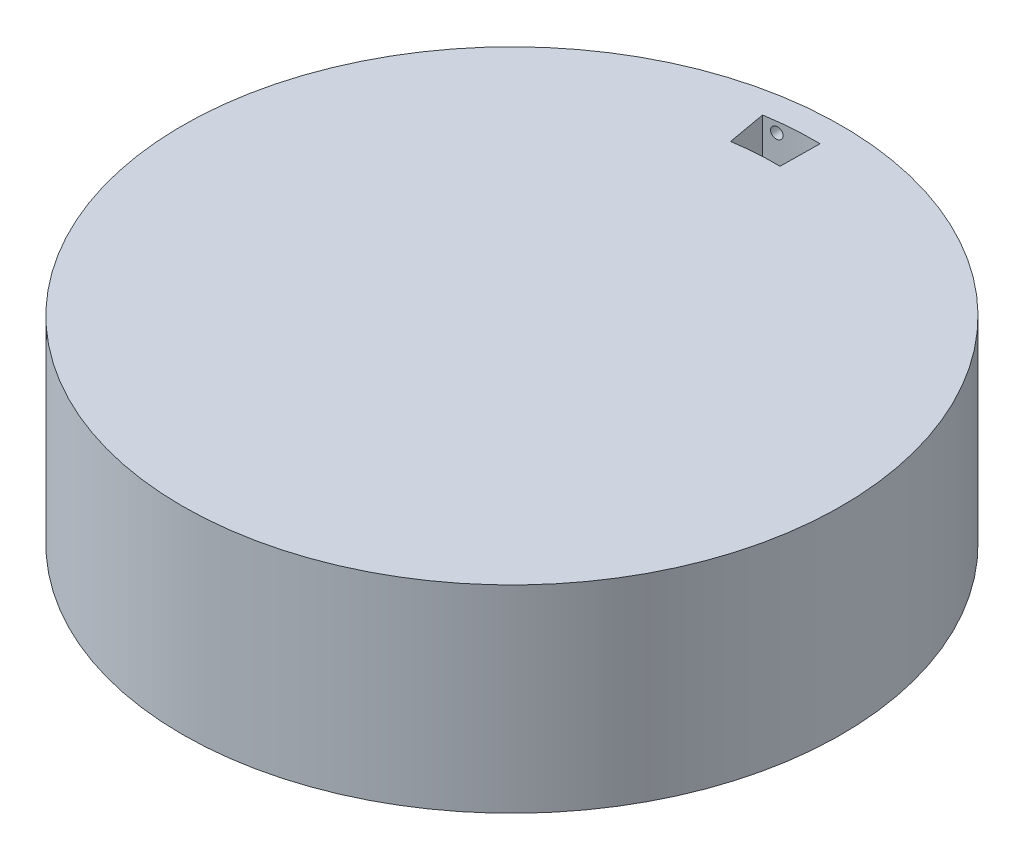
ISO-10303-21;
HEADER;
FILE_DESCRIPTION(('STEP AP214'),'2;1');
FILE_NAME('part.step','',(''),(''),'','','');
FILE_SCHEMA(('AUTOMOTIVE_DESIGN { 1 0 10303 214 1 1 1 1 }'));
ENDSEC;
DATA;
#1=APPLICATION_CONTEXT('core data for automotive mechanical design processes');
#2=APPLICATION_PROTOCOL_DEFINITION('international standard','automotive_design',2000,#1);
#3=PRODUCT_CONTEXT('',#1,'mechanical');
#4=PRODUCT('Part','Part','',(#3));
#5=PRODUCT_RELATED_PRODUCT_CATEGORY('part','',(#4));
#6=PRODUCT_DEFINITION_FORMATION('','',#4);
#7=PRODUCT_DEFINITION_CONTEXT('part definition',#1,'design');
#8=PRODUCT_DEFINITION('design','',#6,#7);
#9=PRODUCT_DEFINITION_SHAPE('','',#8);
#10=(LENGTH_UNIT() NAMED_UNIT(*) SI_UNIT(.MILLI.,.METRE.));
#11=(NAMED_UNIT(*) PLANE_ANGLE_UNIT() SI_UNIT($,.RADIAN.));
#12=(NAMED_UNIT(*) SI_UNIT($,.STERADIAN.) SOLID_ANGLE_UNIT());
#13=UNCERTAINTY_MEASURE_WITH_UNIT(LENGTH_MEASURE(1.E-05),#10,'distance_accuracy_value','');
#14=(GEOMETRIC_REPRESENTATION_CONTEXT(3) GLOBAL_UNCERTAINTY_ASSIGNED_CONTEXT((#13)) GLOBAL_UNIT_ASSIGNED_CONTEXT((#10,
#11,#12)) REPRESENTATION_CONTEXT('',''));
#15=CARTESIAN_POINT('',(0.,0.,0.));
#16=DIRECTION('',(0.,0.,1.));
#17=DIRECTION('',(1.,0.,0.));
#18=AXIS2_PLACEMENT_3D('',#15,#16,#17);
#19=CARTESIAN_POINT('',(0.,19.05,0.));
#20=DIRECTION('',(0.,-1.,0.));
#21=DIRECTION('',(0.,0.,-1.));
#22=AXIS2_PLACEMENT_3D('',#19,#20,#21);
#23=CYLINDRICAL_SURFACE('',#22,31.75);
#24=CARTESIAN_POINT('',(0.,19.05,0.));
#25=DIRECTION('',(0.,1.,0.));
#26=DIRECTION('',(0.,0.,1.));
#27=AXIS2_PLACEMENT_3D('',#24,#25,#26);
#28=CIRCLE('',#27,31.75);
#29=CARTESIAN_POINT('',(0.,19.05,31.75));
#30=VERTEX_POINT('',#29);
#31=EDGE_CURVE('E11',#30,#30,#28,.T.);
#32=ORIENTED_EDGE('',*,*,#31,.F.);
#33=EDGE_LOOP('',(#32));
#34=FACE_BOUND('',#33,.T.);
#35=CARTESIAN_POINT('',(0.,0.,0.));
#36=DIRECTION('',(0.,1.,0.));
#37=DIRECTION('',(0.,0.,1.));
#38=AXIS2_PLACEMENT_3D('',#35,#36,#37);
#39=CIRCLE('',#38,31.75);
#40=CARTESIAN_POINT('',(0.,0.,31.75));
#41=VERTEX_POINT('',#40);
#42=EDGE_CURVE('E46',#41,#41,#39,.T.);
#43=ORIENTED_EDGE('',*,*,#42,.T.);
#44=EDGE_LOOP('',(#43));
#45=FACE_BOUND('',#44,.T.);
#46=CARTESIAN_POINT('',(-3.12525942523335,18.0771235572389,-31.5958106958025));
#47=CARTESIAN_POINT('',(-3.12526076554641,18.0468170057154,-31.5958106025486));
#48=CARTESIAN_POINT('',(-3.1278092079593,18.0164885358174,-31.5955588092377));
#49=CARTESIAN_POINT('',(-3.13793964137095,17.9566670023404,-31.5945542731379));
#50=CARTESIAN_POINT('',(-3.14552767496288,17.9271749860068,-31.5938009289746));
#51=CARTESIAN_POINT('',(-3.1655199468469,17.8699016702083,-31.5918040607363));
#52=CARTESIAN_POINT('',(-3.17792187158234,17.8421195563837,-31.5905607721242));
#53=CARTESIAN_POINT('',(-3.2071846849655,17.7890497276316,-31.5876032900118));
#54=CARTESIAN_POINT('',(-3.22404446720966,17.7637613959032,-31.585889213353));
#55=CARTESIAN_POINT('',(-3.26174699021799,17.7163825279151,-31.5820180590139));
#56=CARTESIAN_POINT('',(-3.2825905216796,17.6942926280149,-31.5798608933826));
#57=CARTESIAN_POINT('',(-3.32766468560591,17.6539419676309,-31.5751430738043));
#58=CARTESIAN_POINT('',(-3.35189545381195,17.6356813606768,-31.5725824036866));
#59=CARTESIAN_POINT('',(-3.40306153070392,17.6035013523667,-31.5671084107032));
#60=CARTESIAN_POINT('',(-3.42999773846586,17.5895834005208,-31.5641949705377));
#61=CARTESIAN_POINT('',(-3.48580107528537,17.5664896632211,-31.5580810242955));
#62=CARTESIAN_POINT('',(-3.51466820690175,17.5573138840516,-31.5548805178383));
#63=CARTESIAN_POINT('',(-3.57353357868338,17.5439574791415,-31.5482683374017));
#64=CARTESIAN_POINT('',(-3.60353258134882,17.5397802850571,-31.5448565200401));
#65=CARTESIAN_POINT('',(-3.66379161835591,17.5365485073161,-31.5379144953203));
#66=CARTESIAN_POINT('',(-3.6940516536695,17.5374939427414,-31.5343842875211));
#67=CARTESIAN_POINT('',(-3.75400228000211,17.5444819290752,-31.5273037060796));
#68=CARTESIAN_POINT('',(-3.7836923476891,17.5505289547919,-31.5237533174522));
#69=CARTESIAN_POINT('',(-3.84163495649671,17.5675538197707,-31.5167446461914));
#70=CARTESIAN_POINT('',(-3.86988748940726,17.5785316871903,-31.5132863640841));
#71=CARTESIAN_POINT('',(-3.92416985953124,17.6051147283195,-31.5065729664682));
#72=CARTESIAN_POINT('',(-3.95019850782746,17.6207223574671,-31.5033179598804));
#73=CARTESIAN_POINT('',(-3.99927829404469,17.6561215171713,-31.4971250431411));
#74=CARTESIAN_POINT('',(-4.02232943577863,17.67591304237,-31.4941871325835));
#75=CARTESIAN_POINT('',(-4.06478979286835,17.7191104888246,-31.4887351764102));
#76=CARTESIAN_POINT('',(-4.0842006297379,17.7425147923179,-31.4862209421258));
#77=CARTESIAN_POINT('',(-4.11884010237718,17.7922812704057,-31.4817083770776));
#78=CARTESIAN_POINT('',(-4.13406877071007,17.8186434219677,-31.4797100422969));
#79=CARTESIAN_POINT('',(-4.15988960830395,17.8735364265157,-31.4763083705999));
#80=CARTESIAN_POINT('',(-4.17048851912529,17.9020640546894,-31.4749041686391));
#81=CARTESIAN_POINT('',(-4.18677883401994,17.9605109909301,-31.4727413980491));
#82=CARTESIAN_POINT('',(-4.19247028804643,17.9904302848279,-31.4719828228482));
#83=CARTESIAN_POINT('',(-4.19877745324486,18.0507602772372,-31.4711419910947));
#84=CARTESIAN_POINT('',(-4.19940121832598,18.0811701190237,-31.4710586613976));
#85=CARTESIAN_POINT('',(-4.19557634551408,18.141663258698,-31.4715687996807));
#86=CARTESIAN_POINT('',(-4.1911277310295,18.1717465580921,-31.4721622645377));
#87=CARTESIAN_POINT('',(-4.17728916214586,18.2307164940178,-31.4740020245004));
#88=CARTESIAN_POINT('',(-4.16790182188518,18.2596037549122,-31.475247974235));
#89=CARTESIAN_POINT('',(-4.14445516685813,18.3153806885418,-31.4783438318953));
#90=CARTESIAN_POINT('',(-4.13039583293448,18.3422703530853,-31.4801937422975));
#91=CARTESIAN_POINT('',(-4.09798933096607,18.3933172098142,-31.4844286864348));
#92=CARTESIAN_POINT('',(-4.07963810278701,18.4174717822876,-31.4868142267902));
#93=CARTESIAN_POINT('',(-4.03917549971209,18.4623380619208,-31.4920303615999));
#94=CARTESIAN_POINT('',(-4.01706408807127,18.4830497354322,-31.4948609604033));
#95=CARTESIAN_POINT('',(-3.96966604581224,18.5204790557008,-31.5008701788292));
#96=CARTESIAN_POINT('',(-3.94437413937999,18.5371899289865,-31.5040493755582));
#97=CARTESIAN_POINT('',(-3.8913597414398,18.56610147699,-31.5106415667075));
#98=CARTESIAN_POINT('',(-3.86363723432777,18.5783021227503,-31.5140545626286));
#99=CARTESIAN_POINT('',(-3.8065102372321,18.5978606131809,-31.5210058225574));
#100=CARTESIAN_POINT('',(-3.77710375606347,18.6052125905344,-31.5245442328943));
#101=CARTESIAN_POINT('',(-3.71747241845715,18.6148410925588,-31.5316317371433));
#102=CARTESIAN_POINT('',(-3.68724755934694,18.617117600653,-31.5351808310902));
#103=CARTESIAN_POINT('',(-3.62683371315476,18.61652886411,-31.5421860697186));
#104=CARTESIAN_POINT('',(-3.59664473032063,18.6136630615754,-31.5456422042734));
#105=CARTESIAN_POINT('',(-3.5371645048993,18.6028676815984,-31.5523670020045));
#106=CARTESIAN_POINT('',(-3.50787326106989,18.5949381111631,-31.5556356654403));
#107=CARTESIAN_POINT('',(-3.4510431567855,18.5742454606783,-31.5619013768801));
#108=CARTESIAN_POINT('',(-3.42350310314376,18.5614857138319,-31.5648986104287));
#109=CARTESIAN_POINT('',(-3.37094017127748,18.5314933424298,-31.5705553009126));
#110=CARTESIAN_POINT('',(-3.34591718323992,18.5142609131232,-31.5732147725849));
#111=CARTESIAN_POINT('',(-3.29912482009234,18.4758304169682,-31.5781384731876));
#112=CARTESIAN_POINT('',(-3.27735233893367,18.4546361800507,-31.5804030797866));
#113=CARTESIAN_POINT('',(-3.23764895735968,18.4088655521131,-31.5844982350258));
#114=CARTESIAN_POINT('',(-3.21971899867532,18.3842883344055,-31.586328677272));
#115=CARTESIAN_POINT('',(-3.18822228296077,18.3324607173417,-31.5895234224894));
#116=CARTESIAN_POINT('',(-3.17465506388848,18.3052106014618,-31.5908877748233));
#117=CARTESIAN_POINT('',(-3.15228119044929,18.2488288117805,-31.5931282231978));
#118=CARTESIAN_POINT('',(-3.14346883335557,18.2196994390364,-31.5940049041644));
#119=CARTESIAN_POINT('',(-3.13320121152909,18.1715079427637,-31.5950243669013));
#120=CARTESIAN_POINT('',(-3.13022678422421,18.1527589722385,-31.5953190255915));
#121=CARTESIAN_POINT('',(-3.12625547176204,18.1150507154179,-31.595712219213));
#122=CARTESIAN_POINT('',(-3.12525858637557,18.0960914291468,-31.5958107541671));
#123=CARTESIAN_POINT('',(-3.12525942523335,18.0771235572389,-31.5958106958025));
#124=B_SPLINE_CURVE_WITH_KNOTS('',3,(#46,#47,#48,#49,#50,#51,#52,#53,#54,#55,#56,#57,#58,#59,
#60,#61,#62,#63,#64,#65,#66,#67,#68,#69,#70,#71,#72,#73,#74,#75,#76,#77,#78,#79,#80,#81,#82,#83,
#84,#85,#86,#87,#88,#89,#90,#91,#92,#93,#94,#95,#96,#97,#98,#99,#100,#101,#102,#103,#104,#105,
#106,#107,#108,#109,#110,#111,#112,#113,#114,#115,#116,#117,#118,#119,#120,#121,#122,#123),
.UNSPECIFIED.,.T.,.F.,(4,2,2,2,2,2,2,2,2,2,2,2,2,2,2,2,2,2,2,2,2,2,2,2,2,2,2,2,2,2,2,2,2,2,2,2,
2,2,4),(0.,0.0908504213364582,0.181809971687633,0.272725860886908,0.363619206656865,
0.454530611774306,0.545445661152898,0.636391024165632,0.727336507698437,0.818344391869951,
0.909352615047019,1.00044074826306,1.09152940164504,1.18266645139431,1.27380338443482,
1.36489962510752,1.45599515646773,1.54695759445728,1.63791910652595,1.72873602815941,
1.81955253068498,1.91032101102541,2.00108986356217,2.0919449333109,2.18280089095693,
2.27380959951642,2.36481889238137,2.45593811343469,2.54705763208613,2.63818703703571,
2.72931631588268,2.82038282263629,2.91144535467068,3.00242030641294,3.09341752899406,
3.18440511120929,3.27528332384855,3.33214361536175,3.38900390028578),.UNSPECIFIED.);
#125=CARTESIAN_POINT('',(-3.12525942523335,18.0771235572389,-31.5958106958025));
#126=VERTEX_POINT('',#125);
#127=EDGE_CURVE('E112',#126,#126,#124,.T.);
#128=ORIENTED_EDGE('',*,*,#127,.F.);
#129=EDGE_LOOP('',(#128));
#130=FACE_BOUND('',#129,.T.);
#131=ADVANCED_FACE('F33',(#34,#45,#130),#23,.T.);
#132=CARTESIAN_POINT('',(0.,13.97,0.));
#133=DIRECTION('',(0.,1.,0.));
#134=DIRECTION('',(0.,0.,1.));
#135=AXIS2_PLACEMENT_3D('',#132,#133,#134);
#136=CYLINDRICAL_SURFACE('',#135,29.21);
#137=CARTESIAN_POINT('',(0.,19.05,0.));
#138=DIRECTION('',(0.,1.,0.));
#139=DIRECTION('',(0.,0.,1.));
#140=AXIS2_PLACEMENT_3D('',#137,#138,#139);
#141=CIRCLE('',#140,29.21);
#142=CARTESIAN_POINT('',(0.481566937098626,19.05,-29.206030084301));
#143=VERTEX_POINT('',#142);
#144=CARTESIAN_POINT('',(-4.6853282453756,19.05,-28.8317845308452));
#145=VERTEX_POINT('',#144);
#146=EDGE_CURVE('E54',#143,#145,#141,.T.);
#147=ORIENTED_EDGE('',*,*,#146,.T.);
#148=DIRECTION('',(0.,1.,0.));
#149=VECTOR('',#148,1.);
#150=CARTESIAN_POINT('',(-4.6853282453756,13.97,-28.8317845308452));
#151=LINE('',#150,#149);
#152=CARTESIAN_POINT('',(-4.6853282453756,13.97,-28.8317845308452));
#153=VERTEX_POINT('',#152);
#154=EDGE_CURVE('E77',#153,#145,#151,.T.);
#155=ORIENTED_EDGE('',*,*,#154,.F.);
#156=CARTESIAN_POINT('',(0.,13.97,0.));
#157=DIRECTION('',(0.,1.,0.));
#158=DIRECTION('',(0.,0.,1.));
#159=AXIS2_PLACEMENT_3D('',#156,#157,#158);
#160=CIRCLE('',#159,29.21);
#161=CARTESIAN_POINT('',(0.481566937098626,13.97,-29.206030084301));
#162=VERTEX_POINT('',#161);
#163=EDGE_CURVE('E104',#162,#153,#160,.T.);
#164=ORIENTED_EDGE('',*,*,#163,.F.);
#165=DIRECTION('',(0.,1.,0.));
#166=VECTOR('',#165,1.);
#167=CARTESIAN_POINT('',(0.481566937098626,13.97,-29.206030084301));
#168=LINE('',#167,#166);
#169=EDGE_CURVE('E62',#162,#143,#168,.T.);
#170=ORIENTED_EDGE('',*,*,#169,.T.);
#171=EDGE_LOOP('',(#147,#155,#164,#170));
#172=FACE_BOUND('',#171,.T.);
#173=CARTESIAN_POINT('',(-2.94501252342107,18.0771235572389,-29.0611596677919));
#174=CARTESIAN_POINT('',(-2.94501386359778,18.1074282862848,-29.0611595747194));
#175=CARTESIAN_POINT('',(-2.94756156666853,18.1377549221551,-29.0609017017233));
#176=CARTESIAN_POINT('',(-2.95768900451406,18.1975728119434,-29.059872688316));
#177=CARTESIAN_POINT('',(-2.96527477716478,18.2270630191715,-29.0591009320385));
#178=CARTESIAN_POINT('',(-2.9852609056362,18.2843327961669,-29.0570545248415));
#179=CARTESIAN_POINT('',(-2.99765894629118,18.3121131810893,-29.055780115742));
#180=CARTESIAN_POINT('',(-3.02691222261363,18.3651797467876,-29.0527471606522));
#181=CARTESIAN_POINT('',(-3.04376635274206,18.3904665440798,-29.0509887347402));
#182=CARTESIAN_POINT('',(-3.08145594911297,18.4378431055732,-29.0470151186832));
#183=CARTESIAN_POINT('',(-3.10229227351677,18.4599321788597,-29.0447998300763));
#184=CARTESIAN_POINT('',(-3.14735003474065,18.5002816737146,-29.0399517921841));
#185=CARTESIAN_POINT('',(-3.1715716077285,18.5185419411997,-29.0373190261057));
#186=CARTESIAN_POINT('',(-3.22271886854145,18.5507231527316,-29.0316869005019));
#187=CARTESIAN_POINT('',(-3.24964562685011,18.5646423699442,-29.0286873957496));
#188=CARTESIAN_POINT('',(-3.30542834278996,18.587739343562,-29.0223884362513));
#189=CARTESIAN_POINT('',(-3.33428430414118,18.596917090824,-29.019088980927));
#190=CARTESIAN_POINT('',(-3.39312954869435,18.6102794305357,-29.0122672228742));
#191=CARTESIAN_POINT('',(-3.42311973123523,18.6144599712151,-29.008744741748));
#192=CARTESIAN_POINT('',(-3.48336030260942,18.617698742081,-29.0015727331815));
#193=CARTESIAN_POINT('',(-3.51361069267136,18.6167569480681,-28.9979232051412));
#194=CARTESIAN_POINT('',(-3.57354662437574,18.6097761987452,-28.9905980828249));
#195=CARTESIAN_POINT('',(-3.60323154742017,18.6037319560947,-28.9869224654335));
#196=CARTESIAN_POINT('',(-3.6611639664627,18.5867115599872,-28.9796623728851));
#197=CARTESIAN_POINT('',(-3.68941145302955,18.5757353741755,-28.9760778983263));
#198=CARTESIAN_POINT('',(-3.74368695401046,18.5491530696839,-28.969115587179));
#199=CARTESIAN_POINT('',(-3.76971356243814,18.533544045652,-28.9657378818682));
#200=CARTESIAN_POINT('',(-3.81878951352731,18.4981395704351,-28.9593086961582));
#201=CARTESIAN_POINT('',(-3.84183886045167,18.4783441252443,-28.9562572152919));
#202=CARTESIAN_POINT('',(-3.88429396416955,18.4351378063948,-28.950592738537));
#203=CARTESIAN_POINT('',(-3.90370163461588,18.4117288434464,-28.9479795124283));
#204=CARTESIAN_POINT('',(-3.93833498705057,18.3619507266019,-28.9432880641707));
#205=CARTESIAN_POINT('',(-3.95356070765966,18.3355816000466,-28.941209837081));
#206=CARTESIAN_POINT('',(-3.97937182408964,18.2806799560579,-28.937672161833));
#207=CARTESIAN_POINT('',(-3.98996518633458,18.2521512524618,-28.9362116515092));
#208=CARTESIAN_POINT('',(-4.00624606078686,18.1937015390188,-28.9339620625273));
#209=CARTESIAN_POINT('',(-4.01193363202349,18.1637805459294,-28.9331729757901));
#210=CARTESIAN_POINT('',(-4.01823353636565,18.1034558550299,-28.932298725795));
#211=CARTESIAN_POINT('',(-4.01885538498896,18.0730531697711,-28.932212242758));
#212=CARTESIAN_POINT('',(-4.01503104899324,18.01257459304,-28.9327432032401));
#213=CARTESIAN_POINT('',(-4.01058489202697,17.9824986997857,-28.9333606429182));
#214=CARTESIAN_POINT('',(-3.99675644548081,17.9235465426482,-28.9352740800931));
#215=CARTESIAN_POINT('',(-3.98737724187348,17.8946695409444,-28.9365696533665));
#216=CARTESIAN_POINT('',(-3.96395244193601,17.8389123363818,-28.939787836204));
#217=CARTESIAN_POINT('',(-3.94990682289545,17.8120321432418,-28.9417104488197));
#218=CARTESIAN_POINT('',(-3.91753035908319,17.7609980131804,-28.9461106553269));
#219=CARTESIAN_POINT('',(-3.89919472123731,17.7368471707478,-28.9485888698407));
#220=CARTESIAN_POINT('',(-3.8587668293795,17.6919865177031,-28.9540054811888));
#221=CARTESIAN_POINT('',(-3.83667453230696,17.6712767465396,-28.9569438832978));
#222=CARTESIAN_POINT('',(-3.78931012920254,17.6338426618608,-28.9631800628777));
#223=CARTESIAN_POINT('',(-3.76403179286047,17.6171263482339,-28.9664785427421));
#224=CARTESIAN_POINT('',(-3.7110445063369,17.5882030866645,-28.9733146422656));
#225=CARTESIAN_POINT('',(-3.68333553725029,17.5759961737993,-28.9768522637847));
#226=CARTESIAN_POINT('',(-3.6262283525028,17.5564219862342,-28.9840541796216));
#227=CARTESIAN_POINT('',(-3.59682778135366,17.5490616466663,-28.987718647596));
#228=CARTESIAN_POINT('',(-3.53720614116574,17.5394178644876,-28.9950543112095));
#229=CARTESIAN_POINT('',(-3.5069850692261,17.5371344398284,-28.9987255068723));
#230=CARTESIAN_POINT('',(-3.44657587109917,17.5377112834287,-29.0059673226669));
#231=CARTESIAN_POINT('',(-3.41638774966688,17.5405722155273,-29.0095379297581));
#232=CARTESIAN_POINT('',(-3.35690719176623,17.5513605546064,-29.0164810241249));
#233=CARTESIAN_POINT('',(-3.32761475350472,17.5592879514431,-29.0198535117971));
#234=CARTESIAN_POINT('',(-3.27078445373798,17.5799780482676,-29.0263136993222));
#235=CARTESIAN_POINT('',(-3.24324517787049,17.5927367913128,-29.0294016296653));
#236=CARTESIAN_POINT('',(-3.19068247815141,17.6227293585394,-29.035225940978));
#237=CARTESIAN_POINT('',(-3.16565894253483,17.6399629837965,-29.0379623375664));
#238=CARTESIAN_POINT('',(-3.11886856368138,17.6783951285642,-29.0430252058788));
#239=CARTESIAN_POINT('',(-3.09709811203138,17.6995891953976,-29.0453521323155));
#240=CARTESIAN_POINT('',(-3.0573977112431,17.7453605733204,-29.0495579817555));
#241=CARTESIAN_POINT('',(-3.03946870094787,17.7699387090663,-29.0514367952531));
#242=CARTESIAN_POINT('',(-3.00797495693632,17.8217663912502,-29.0547145590086));
#243=CARTESIAN_POINT('',(-2.99440929871009,17.8490153701898,-29.0561136109227));
#244=CARTESIAN_POINT('',(-2.97203729382089,17.90539531885,-29.0584105208562));
#245=CARTESIAN_POINT('',(-2.96322524669808,17.9345239873091,-29.0593089792226));
#246=CARTESIAN_POINT('',(-2.95295640250142,17.9827187814068,-29.0603538016617));
#247=CARTESIAN_POINT('',(-2.94998119502738,18.0014717296258,-29.0606557909923));
#248=CARTESIAN_POINT('',(-2.94600883611971,18.0391881090301,-29.0610587531773));
#249=CARTESIAN_POINT('',(-2.94501168441487,18.0581515401865,-29.0611597260591));
#250=CARTESIAN_POINT('',(-2.94501252342107,18.0771235572389,-29.0611596677919));
#251=B_SPLINE_CURVE_WITH_KNOTS('',3,(#173,#174,#175,#176,#177,#178,#179,#180,#181,#182,#183,
#184,#185,#186,#187,#188,#189,#190,#191,#192,#193,#194,#195,#196,#197,#198,#199,#200,#201,#202,
#203,#204,#205,#206,#207,#208,#209,#210,#211,#212,#213,#214,#215,#216,#217,#218,#219,#220,#221,
#222,#223,#224,#225,#226,#227,#228,#229,#230,#231,#232,#233,#234,#235,#236,#237,#238,#239,#240,
#241,#242,#243,#244,#245,#246,#247,#248,#249,#250),.UNSPECIFIED.,.T.,.F.,(4,2,2,2,2,2,2,2,2,2,2,
2,2,2,2,2,2,2,2,2,2,2,2,2,2,2,2,2,2,2,2,2,2,2,2,2,2,2,4),(0.,0.0908449386639816,
0.181798947407008,0.272709252614819,0.363597024447625,0.454504404690006,0.545415442630856,
0.63636259824217,0.727309929229972,0.81833095104538,0.909352402871952,1.00046829033597,
1.09158477554956,1.18275852303061,1.27393213996691,1.36505771137231,1.45618244119561,
1.54714983844929,1.63811614111572,1.72891153202878,1.81970642753335,1.9104445917921,
2.00118319766039,2.09202367053803,2.18286518474251,2.27388717911662,2.36490988150958,
2.45606255006651,2.54721554093234,2.63838029522555,2.72954486699694,2.82063493458943,
2.91172095359919,3.00270517519084,3.09371160790241,3.18469874538974,3.27557652852192,
3.33244923506078,3.38932193380187),.UNSPECIFIED.);
#252=CARTESIAN_POINT('',(-2.94501252342107,18.0771235572389,-29.0611596677919));
#253=VERTEX_POINT('',#252);
#254=EDGE_CURVE('E151',#253,#253,#251,.T.);
#255=ORIENTED_EDGE('',*,*,#254,.F.);
#256=EDGE_LOOP('',(#255));
#257=FACE_BOUND('',#256,.T.);
#258=ADVANCED_FACE('F136',(#172,#257),#136,.F.);
#259=CARTESIAN_POINT('',(0.,13.97,0.));
#260=DIRECTION('',(0.,1.,0.));
#261=DIRECTION('',(0.,0.,1.));
#262=AXIS2_PLACEMENT_3D('',#259,#260,#261);
#263=CYLINDRICAL_SURFACE('',#262,25.4);
#264=CARTESIAN_POINT('',(0.,19.05,0.));
#265=DIRECTION('',(0.,-1.,0.));
#266=DIRECTION('',(0.,0.,1.));
#267=AXIS2_PLACEMENT_3D('',#264,#265,#266);
#268=CIRCLE('',#267,25.4);
#269=CARTESIAN_POINT('',(-4.02136453273724,19.05,-25.0796456772189));
#270=VERTEX_POINT('',#269);
#271=CARTESIAN_POINT('',(0.431861346172182,19.05,-25.3963283916727));
#272=VERTEX_POINT('',#271);
#273=EDGE_CURVE('E114',#270,#272,#268,.T.);
#274=ORIENTED_EDGE('',*,*,#273,.T.);
#275=DIRECTION('',(0.,1.,0.));
#276=VECTOR('',#275,1.);
#277=CARTESIAN_POINT('',(0.431861346172182,13.97,-25.3963283916727));
#278=LINE('',#277,#276);
#279=CARTESIAN_POINT('',(0.431861346172182,13.97,-25.3963283916727));
#280=VERTEX_POINT('',#279);
#281=EDGE_CURVE('E93',#280,#272,#278,.T.);
#282=ORIENTED_EDGE('',*,*,#281,.F.);
#283=CARTESIAN_POINT('',(0.,13.97,0.));
#284=DIRECTION('',(0.,-1.,0.));
#285=DIRECTION('',(0.,0.,1.));
#286=AXIS2_PLACEMENT_3D('',#283,#284,#285);
#287=CIRCLE('',#286,25.4);
#288=CARTESIAN_POINT('',(-4.02136453273724,13.97,-25.0796456772189));
#289=VERTEX_POINT('',#288);
#290=EDGE_CURVE('E96',#289,#280,#287,.T.);
#291=ORIENTED_EDGE('',*,*,#290,.F.);
#292=DIRECTION('',(0.,1.,0.));
#293=VECTOR('',#292,1.);
#294=CARTESIAN_POINT('',(-4.02136453273724,13.97,-25.0796456772189));
#295=LINE('',#294,#293);
#296=EDGE_CURVE('E82',#289,#270,#295,.T.);
#297=ORIENTED_EDGE('',*,*,#296,.T.);
#298=EDGE_LOOP('',(#274,#282,#291,#297));
#299=FACE_BOUND('',#298,.T.);
#300=CARTESIAN_POINT('',(-2.67461416755995,18.0771235572389,-25.2587893426167));
#301=CARTESIAN_POINT('',(-2.67461550744712,18.0468226551354,-25.2587892498817));
#302=CARTESIAN_POINT('',(-2.67716175582264,18.0164998703932,-25.2585199850201));
#303=CARTESIAN_POINT('',(-2.68728329734136,17.9566896316231,-25.2574451079867));
#304=CARTESIAN_POINT('',(-2.69486461871562,17.9272032231223,-25.2566388529012));
#305=CARTESIAN_POINT('',(-2.71483864464466,17.86994087688,-25.2544996276648));
#306=CARTESIAN_POINT('',(-2.72722903055632,17.8421641223117,-25.2531669113365));
#307=CARTESIAN_POINT('',(-2.75646349677932,17.7891044084753,-25.2499925568224));
#308=CARTESIAN_POINT('',(-2.77330647331025,17.7638208332873,-25.24815104476));
#309=CARTESIAN_POINT('',(-2.8109705772842,17.7164491158849,-25.2439854699656));
#310=CARTESIAN_POINT('',(-2.83179270433639,17.694361779058,-25.2416612859679));
#311=CARTESIAN_POINT('',(-2.87681812182591,17.6540147334036,-25.2365692935231));
#312=CARTESIAN_POINT('',(-2.90102154933415,17.6357551798215,-25.233801467091));
#313=CARTESIAN_POINT('',(-2.95213184424679,17.603571445609,-25.2278730527892));
#314=CARTESIAN_POINT('',(-2.97904014124037,17.5896495736527,-25.2247122570145));
#315=CARTESIAN_POINT('',(-3.03478252637318,17.5665458094646,-25.2180665812164));
#316=CARTESIAN_POINT('',(-3.06361662066011,17.5573639323652,-25.2145817001584));
#317=CARTESIAN_POINT('',(-3.12242294806173,17.543989135657,-25.2073670370151));
#318=CARTESIAN_POINT('',(-3.15239636686672,17.5398015689045,-25.2036369966783));
#319=CARTESIAN_POINT('',(-3.21260181220643,17.5365481141318,-25.1960336191144));
#320=CARTESIAN_POINT('',(-3.24283384050314,17.537482261035,-25.1921602809105));
#321=CARTESIAN_POINT('',(-3.30274277365567,17.5444478052671,-25.1843761898566));
#322=CARTESIAN_POINT('',(-3.33241885966367,17.5504861967417,-25.1804653929518));
#323=CARTESIAN_POINT('',(-3.39033382360472,17.5674971902045,-25.1727330790392));
#324=CARTESIAN_POINT('',(-3.41857268953588,17.5784698333899,-25.1689115627772));
#325=CARTESIAN_POINT('',(-3.47283766944364,17.6050505706365,-25.1614814742944));
#326=CARTESIAN_POINT('',(-3.49886192044158,17.6206625187447,-25.1578730821235));
#327=CARTESIAN_POINT('',(-3.54793352443009,17.656078149778,-25.1509996339152));
#328=CARTESIAN_POINT('',(-3.57098088260499,17.6758818254028,-25.1477345772799));
#329=CARTESIAN_POINT('',(-3.61342830304251,17.7191067908175,-25.1416705161574));
#330=CARTESIAN_POINT('',(-3.63283089026549,17.7425255555675,-25.1388711891852));
#331=CARTESIAN_POINT('',(-3.66745421872789,17.7923281588326,-25.1338434513466));
#332=CARTESIAN_POINT('',(-3.68267501135973,17.8187119609031,-25.131615033464));
#333=CARTESIAN_POINT('',(-3.7084678680725,17.8736317926916,-25.1278219603257));
#334=CARTESIAN_POINT('',(-3.71905047262777,17.9021627680045,-25.1262558003499));
#335=CARTESIAN_POINT('',(-3.73531289960954,17.9606183425708,-25.123843370856));
#336=CARTESIAN_POINT('',(-3.74099280017963,17.9905429196038,-25.1229970898639));
#337=CARTESIAN_POINT('',(-3.74727798996455,18.0508564831042,-25.122060384205));
#338=CARTESIAN_POINT('',(-3.74789586461802,18.0812441294954,-25.1219680849562));
#339=CARTESIAN_POINT('',(-3.74407231993178,18.1416921022089,-25.1225382089978));
#340=CARTESIAN_POINT('',(-3.73963093711403,18.1717524308925,-25.12320062684));
#341=CARTESIAN_POINT('',(-3.72582255392718,18.2306672317976,-25.1252521271901));
#342=CARTESIAN_POINT('',(-3.71645962793233,18.2595226801996,-25.1266406086104));
#343=CARTESIAN_POINT('',(-3.69307872036102,18.3152384348165,-25.1300877117485));
#344=CARTESIAN_POINT('',(-3.67906070864635,18.3420987281129,-25.1321463378049));
#345=CARTESIAN_POINT('',(-3.646744620285,18.3931061077744,-25.1368558034768));
#346=CARTESIAN_POINT('',(-3.62844021517547,18.4172491035016,-25.1395075184708));
#347=CARTESIAN_POINT('',(-3.58808195416202,18.4620979101793,-25.1452994094688));
#348=CARTESIAN_POINT('',(-3.56602804200785,18.482803669555,-25.1484395928009));
#349=CARTESIAN_POINT('',(-3.51873063136943,18.5202477258346,-25.1551009837649));
#350=CARTESIAN_POINT('',(-3.49347890082319,18.5369754504045,-25.1586231712954));
#351=CARTESIAN_POINT('',(-3.44054468774911,18.5659232855898,-25.1659167359248));
#352=CARTESIAN_POINT('',(-3.41286217938095,18.5781433482795,-25.1696881156725));
#353=CARTESIAN_POINT('',(-3.3557926613433,18.5977504984726,-25.1773605728793));
#354=CARTESIAN_POINT('',(-3.32640252844005,18.6051284061382,-25.1812618820395));
#355=CARTESIAN_POINT('',(-3.26679737186515,18.6148042933278,-25.1890638571758));
#356=CARTESIAN_POINT('',(-3.23658234480631,18.6171022519892,-25.1929645231492));
#357=CARTESIAN_POINT('',(-3.17617919693151,18.6165504038435,-25.2006510388328));
#358=CARTESIAN_POINT('',(-3.14599108166431,18.6136997078283,-25.2044368685951));
#359=CARTESIAN_POINT('',(-3.08650638517822,18.6029261640151,-25.2117904329974));
#360=CARTESIAN_POINT('',(-3.05720980101523,18.5950033329689,-25.2153581683576));
#361=CARTESIAN_POINT('',(-3.00037601573487,18.5743185909838,-25.2221839413853));
#362=CARTESIAN_POINT('',(-2.97283693690015,18.5615619491537,-25.225442311458));
#363=CARTESIAN_POINT('',(-2.92027207014236,18.5315689505498,-25.2315816419179));
#364=CARTESIAN_POINT('',(-2.89524616634339,18.5143328004459,-25.2344626197075));
#365=CARTESIAN_POINT('',(-2.84845775205844,18.4758971665653,-25.2397869071125));
#366=CARTESIAN_POINT('',(-2.82669057796024,18.4547034461267,-25.2422308431783));
#367=CARTESIAN_POINT('',(-2.78699469154663,18.4089304702692,-25.246644542352));
#368=CARTESIAN_POINT('',(-2.76906691206526,18.3843503944669,-25.2486141902394));
#369=CARTESIAN_POINT('',(-2.73757810660235,18.3325225553218,-25.2520477919335));
#370=CARTESIAN_POINT('',(-2.72401518472563,18.3052759569196,-25.2535119653154));
#371=CARTESIAN_POINT('',(-2.7016462292294,18.2488998616938,-25.2559148600383));
#372=CARTESIAN_POINT('',(-2.69283449964069,18.2197726665666,-25.2568542106124));
#373=CARTESIAN_POINT('',(-2.68256271676862,18.1715709761685,-25.2579467078492));
#374=CARTESIAN_POINT('',(-2.67958576763051,18.1528097095862,-25.2582624932079));
#375=CARTESIAN_POINT('',(-2.67561107354905,18.1150763431983,-25.2586838396174));
#376=CARTESIAN_POINT('',(-2.67461332824573,18.0961042434312,-25.2587894007065));
#377=CARTESIAN_POINT('',(-2.67461416755995,18.0771235572389,-25.2587893426167));
#378=B_SPLINE_CURVE_WITH_KNOTS('',3,(#300,#301,#302,#303,#304,#305,#306,#307,#308,#309,#310,
#311,#312,#313,#314,#315,#316,#317,#318,#319,#320,#321,#322,#323,#324,#325,#326,#327,#328,#329,
#330,#331,#332,#333,#334,#335,#336,#337,#338,#339,#340,#341,#342,#343,#344,#345,#346,#347,#348,
#349,#350,#351,#352,#353,#354,#355,#356,#357,#358,#359,#360,#361,#362,#363,#364,#365,#366,#367,
#368,#369,#370,#371,#372,#373,#374,#375,#376,#377),.UNSPECIFIED.,.T.,.F.,(4,2,2,2,2,2,2,2,2,2,2,
2,2,2,2,2,2,2,2,2,2,2,2,2,2,2,2,2,2,2,2,2,2,2,2,2,2,2,4),(0.,0.0908334259532294,
0.181775798560876,0.272674378557677,0.363550446235189,0.454449373125426,0.545351985939576,
0.636302898153423,0.72725410072277,0.81830269660892,0.909351913328998,1.00052609383547,
1.09170103559183,1.18295193259656,1.2742026706836,1.36538995865973,1.45657612593388,
1.54755398059181,1.63853038513804,1.72928053116164,1.82003002207871,1.91070450270215,
2.00137957038687,2.09218936498188,2.18300052202919,2.27405039407994,2.36510123415151,
2.45632419508323,2.54754753065105,2.63878662262558,2.73002541326731,2.82116503358961,
2.9123004497724,3.00330416775054,3.09432997131959,3.18531618389831,3.2761930737032,
3.33309174495255,3.38999040585377),.UNSPECIFIED.);
#379=CARTESIAN_POINT('',(-2.67461416755995,18.0771235572389,-25.2587893426167));
#380=VERTEX_POINT('',#379);
#381=EDGE_CURVE('E37',#380,#380,#378,.T.);
#382=ORIENTED_EDGE('',*,*,#381,.F.);
#383=EDGE_LOOP('',(#382));
#384=FACE_BOUND('',#383,.T.);
#385=ADVANCED_FACE('F97',(#299,#384),#263,.T.);
#386=CARTESIAN_POINT('',(0.,19.05,0.));
#387=DIRECTION('',(0.,1.,0.));
#388=DIRECTION('',(0.,0.,1.));
#389=AXIS2_PLACEMENT_3D('',#386,#387,#388);
#390=PLANE('',#389);
#391=ORIENTED_EDGE('',*,*,#146,.F.);
#392=DIRECTION('',(0.0130459980488552,0.,-0.999914897346224));
#393=VECTOR('',#392,1.);
#394=CARTESIAN_POINT('',(0.431861346172182,19.05,-25.3963283916727));
#395=LINE('',#394,#393);
#396=EDGE_CURVE('E106',#272,#143,#395,.T.);
#397=ORIENTED_EDGE('',*,*,#396,.F.);
#398=ORIENTED_EDGE('',*,*,#273,.F.);
#399=DIRECTION('',(0.174248923048996,0.,0.984701636444393));
#400=VECTOR('',#399,1.);
#401=CARTESIAN_POINT('',(-4.02136453273724,19.05,-25.0796456772189));
#402=LINE('',#401,#400);
#403=EDGE_CURVE('E89',#145,#270,#402,.T.);
#404=ORIENTED_EDGE('',*,*,#403,.F.);
#405=EDGE_LOOP('',(#391,#397,#398,#404));
#406=FACE_BOUND('',#405,.T.);
#407=ORIENTED_EDGE('',*,*,#31,.T.);
#408=EDGE_LOOP('',(#407));
#409=FACE_BOUND('',#408,.T.);
#410=ADVANCED_FACE('F127',(#406,#409),#390,.T.);
#411=CARTESIAN_POINT('',(0.,0.,0.));
#412=DIRECTION('',(0.,1.,0.));
#413=DIRECTION('',(0.,0.,1.));
#414=AXIS2_PLACEMENT_3D('',#411,#412,#413);
#415=PLANE('',#414);
#416=ORIENTED_EDGE('',*,*,#42,.F.);
#417=EDGE_LOOP('',(#416));
#418=FACE_BOUND('',#417,.T.);
#419=ADVANCED_FACE('F124',(#418),#415,.F.);
#420=CARTESIAN_POINT('',(0.431861346172182,13.97,-25.3963283916727));
#421=DIRECTION('',(0.999914897346224,0.,0.0130459980488552));
#422=DIRECTION('',(0.0130459980488552,0.,-0.999914897346224));
#423=AXIS2_PLACEMENT_3D('',#420,#421,#422);
#424=PLANE('',#423);
#425=ORIENTED_EDGE('',*,*,#396,.T.);
#426=ORIENTED_EDGE('',*,*,#169,.F.);
#427=DIRECTION('',(0.0130459980488552,0.,-0.999914897346224));
#428=VECTOR('',#427,1.);
#429=CARTESIAN_POINT('',(0.431861346172182,13.97,-25.3963283916727));
#430=LINE('',#429,#428);
#431=EDGE_CURVE('E101',#280,#162,#430,.T.);
#432=ORIENTED_EDGE('',*,*,#431,.F.);
#433=ORIENTED_EDGE('',*,*,#281,.T.);
#434=EDGE_LOOP('',(#425,#426,#432,#433));
#435=FACE_BOUND('',#434,.T.);
#436=ADVANCED_FACE('F126',(#435),#424,.F.);
#437=CARTESIAN_POINT('',(-4.02136453273724,13.97,-25.0796456772189));
#438=DIRECTION('',(-0.984701636444393,0.,0.174248923048996));
#439=DIRECTION('',(0.174248923048996,0.,0.984701636444393));
#440=AXIS2_PLACEMENT_3D('',#437,#438,#439);
#441=PLANE('',#440);
#442=ORIENTED_EDGE('',*,*,#403,.T.);
#443=ORIENTED_EDGE('',*,*,#296,.F.);
#444=DIRECTION('',(0.174248923048996,0.,0.984701636444393));
#445=VECTOR('',#444,1.);
#446=CARTESIAN_POINT('',(-4.02136453273724,13.97,-25.0796456772189));
#447=LINE('',#446,#445);
#448=EDGE_CURVE('E86',#153,#289,#447,.T.);
#449=ORIENTED_EDGE('',*,*,#448,.F.);
#450=ORIENTED_EDGE('',*,*,#154,.T.);
#451=EDGE_LOOP('',(#442,#443,#449,#450));
#452=FACE_BOUND('',#451,.T.);
#453=ADVANCED_FACE('F84',(#452),#441,.F.);
#454=CARTESIAN_POINT('',(0.,13.97,0.));
#455=DIRECTION('',(0.,1.,0.));
#456=DIRECTION('',(0.,0.,1.));
#457=AXIS2_PLACEMENT_3D('',#454,#455,#456);
#458=PLANE('',#457);
#459=ORIENTED_EDGE('',*,*,#163,.T.);
#460=ORIENTED_EDGE('',*,*,#448,.T.);
#461=ORIENTED_EDGE('',*,*,#290,.T.);
#462=ORIENTED_EDGE('',*,*,#431,.T.);
#463=EDGE_LOOP('',(#459,#460,#461,#462));
#464=FACE_BOUND('',#463,.T.);
#465=ADVANCED_FACE('F103',(#464),#458,.T.);
#466=CARTESIAN_POINT('',(-1.68664822163672,0.,-23.7178259702691));
#467=DIRECTION('',(-0.0709339708962104,0.,-0.997481013239298));
#468=DIRECTION('',(-0.997481013239298,0.,0.0709339708962104));
#469=AXIS2_PLACEMENT_3D('',#466,#467,#468);
#470=PLANE('',#469);
#471=CARTESIAN_POINT('',(-3.09897724710752,18.0771235572389,-23.6173908695916));
#472=DIRECTION('',(-0.0709339708962104,0.,-0.997481013239298));
#473=DIRECTION('',(-0.997481013239298,0.,0.0709339708962104));
#474=AXIS2_PLACEMENT_3D('',#471,#472,#473);
#475=CIRCLE('',#474,0.539725026083106);
#476=CARTESIAN_POINT('',(-3.6373427129955,18.0771235572389,-23.5791060302995));
#477=VERTEX_POINT('',#476);
#478=EDGE_CURVE('E156',#477,#477,#475,.T.);
#479=ORIENTED_EDGE('',*,*,#478,.T.);
#480=EDGE_LOOP('',(#479));
#481=FACE_BOUND('',#480,.T.);
#482=ADVANCED_FACE('F166',(#481),#470,.T.);
#483=CARTESIAN_POINT('',(-3.81856365259514,18.0771235572389,-33.7362911340257));
#484=DIRECTION('',(0.07093397089621,0.,0.997481013239297));
#485=DIRECTION('',(0.997481013239298,0.,-0.07093397089621));
#486=AXIS2_PLACEMENT_3D('',#483,#484,#485);
#487=CYLINDRICAL_SURFACE('',#486,0.539725026083106);
#488=ORIENTED_EDGE('',*,*,#478,.F.);
#489=EDGE_LOOP('',(#488));
#490=FACE_BOUND('',#489,.T.);
#491=ORIENTED_EDGE('',*,*,#381,.T.);
#492=EDGE_LOOP('',(#491));
#493=FACE_BOUND('',#492,.T.);
#494=ADVANCED_FACE('F164',(#490,#493),#487,.F.);
#495=ORIENTED_EDGE('',*,*,#254,.T.);
#496=EDGE_LOOP('',(#495));
#497=FACE_BOUND('',#496,.T.);
#498=ORIENTED_EDGE('',*,*,#127,.T.);
#499=EDGE_LOOP('',(#498));
#500=FACE_BOUND('',#499,.T.);
#501=ADVANCED_FACE('F159',(#497,#500),#487,.F.);
#502=CLOSED_SHELL('',(#131,#258,#385,#410,#419,#436,#453,#465,#482,#494,#501));
#503=MANIFOLD_SOLID_BREP('B2',#502);
#504=ADVANCED_BREP_SHAPE_REPRESENTATION('',(#18,#503),#14);
#505=SHAPE_DEFINITION_REPRESENTATION(#9,#504);
ENDSEC;
END-ISO-10303-21;
